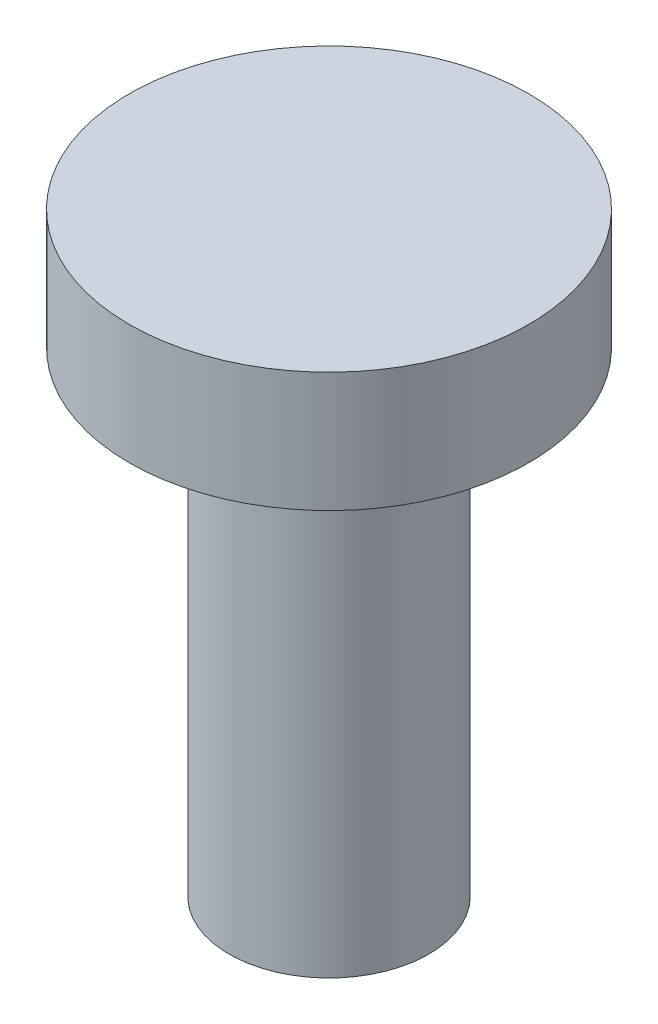
ISO-10303-21;
HEADER;
FILE_DESCRIPTION(('STEP AP214'),'2;1');
FILE_NAME('part.step','',(''),(''),'','','');
FILE_SCHEMA(('AUTOMOTIVE_DESIGN { 1 0 10303 214 1 1 1 1 }'));
ENDSEC;
DATA;
#1=APPLICATION_CONTEXT('core data for automotive mechanical design processes');
#2=APPLICATION_PROTOCOL_DEFINITION('international standard','automotive_design',2000,#1);
#3=PRODUCT_CONTEXT('',#1,'mechanical');
#4=PRODUCT('Part','Part','',(#3));
#5=PRODUCT_RELATED_PRODUCT_CATEGORY('part','',(#4));
#6=PRODUCT_DEFINITION_FORMATION('','',#4);
#7=PRODUCT_DEFINITION_CONTEXT('part definition',#1,'design');
#8=PRODUCT_DEFINITION('design','',#6,#7);
#9=PRODUCT_DEFINITION_SHAPE('','',#8);
#10=(LENGTH_UNIT() NAMED_UNIT(*) SI_UNIT(.MILLI.,.METRE.));
#11=(NAMED_UNIT(*) PLANE_ANGLE_UNIT() SI_UNIT($,.RADIAN.));
#12=(NAMED_UNIT(*) SI_UNIT($,.STERADIAN.) SOLID_ANGLE_UNIT());
#13=UNCERTAINTY_MEASURE_WITH_UNIT(LENGTH_MEASURE(1.E-05),#10,'distance_accuracy_value','');
#14=(GEOMETRIC_REPRESENTATION_CONTEXT(3) GLOBAL_UNCERTAINTY_ASSIGNED_CONTEXT((#13)) GLOBAL_UNIT_ASSIGNED_CONTEXT((#10,
#11,#12)) REPRESENTATION_CONTEXT('',''));
#15=CARTESIAN_POINT('',(0.,0.,0.));
#16=DIRECTION('',(0.,0.,1.));
#17=DIRECTION('',(1.,0.,0.));
#18=AXIS2_PLACEMENT_3D('',#15,#16,#17);
#19=CARTESIAN_POINT('',(0.,3.,0.));
#20=DIRECTION('',(0.,-1.,0.));
#21=DIRECTION('',(0.,0.,-1.));
#22=AXIS2_PLACEMENT_3D('',#19,#20,#21);
#23=CYLINDRICAL_SURFACE('',#22,5.);
#24=CARTESIAN_POINT('',(0.,3.,0.));
#25=DIRECTION('',(0.,1.,0.));
#26=DIRECTION('',(0.,0.,1.));
#27=AXIS2_PLACEMENT_3D('',#24,#25,#26);
#28=CIRCLE('',#27,5.);
#29=CARTESIAN_POINT('',(0.,3.,5.));
#30=VERTEX_POINT('',#29);
#31=EDGE_CURVE('E38',#30,#30,#28,.T.);
#32=ORIENTED_EDGE('',*,*,#31,.F.);
#33=EDGE_LOOP('',(#32));
#34=FACE_BOUND('',#33,.T.);
#35=CARTESIAN_POINT('',(0.,0.,0.));
#36=DIRECTION('',(0.,1.,0.));
#37=DIRECTION('',(0.,0.,1.));
#38=AXIS2_PLACEMENT_3D('',#35,#36,#37);
#39=CIRCLE('',#38,5.);
#40=CARTESIAN_POINT('',(0.,0.,5.));
#41=VERTEX_POINT('',#40);
#42=EDGE_CURVE('E34',#41,#41,#39,.T.);
#43=ORIENTED_EDGE('',*,*,#42,.T.);
#44=EDGE_LOOP('',(#43));
#45=FACE_BOUND('',#44,.T.);
#46=ADVANCED_FACE('F31',(#34,#45),#23,.T.);
#47=CARTESIAN_POINT('',(0.,3.,0.));
#48=DIRECTION('',(0.,1.,0.));
#49=DIRECTION('',(0.,0.,1.));
#50=AXIS2_PLACEMENT_3D('',#47,#48,#49);
#51=PLANE('',#50);
#52=ORIENTED_EDGE('',*,*,#31,.T.);
#53=EDGE_LOOP('',(#52));
#54=FACE_BOUND('',#53,.T.);
#55=ADVANCED_FACE('F55',(#54),#51,.T.);
#56=CARTESIAN_POINT('',(0.,0.,0.));
#57=DIRECTION('',(0.,1.,0.));
#58=DIRECTION('',(0.,0.,1.));
#59=AXIS2_PLACEMENT_3D('',#56,#57,#58);
#60=PLANE('',#59);
#61=CARTESIAN_POINT('',(0.,0.,0.));
#62=DIRECTION('',(0.,-1.,0.));
#63=DIRECTION('',(0.,0.,-1.));
#64=AXIS2_PLACEMENT_3D('',#61,#62,#63);
#65=CIRCLE('',#64,2.5);
#66=CARTESIAN_POINT('',(0.,0.,-2.5));
#67=VERTEX_POINT('',#66);
#68=EDGE_CURVE('E10',#67,#67,#65,.T.);
#69=ORIENTED_EDGE('',*,*,#68,.F.);
#70=EDGE_LOOP('',(#69));
#71=FACE_BOUND('',#70,.T.);
#72=ORIENTED_EDGE('',*,*,#42,.F.);
#73=EDGE_LOOP('',(#72));
#74=FACE_BOUND('',#73,.T.);
#75=ADVANCED_FACE('F52',(#71,#74),#60,.F.);
#76=CARTESIAN_POINT('',(0.,-11.8999,0.));
#77=DIRECTION('',(0.,1.,0.));
#78=DIRECTION('',(0.,0.,1.));
#79=AXIS2_PLACEMENT_3D('',#76,#77,#78);
#80=CYLINDRICAL_SURFACE('',#79,2.5);
#81=CARTESIAN_POINT('',(0.,-11.8999,0.));
#82=DIRECTION('',(0.,-1.,0.));
#83=DIRECTION('',(0.,0.,-1.));
#84=AXIS2_PLACEMENT_3D('',#81,#82,#83);
#85=CIRCLE('',#84,2.5);
#86=CARTESIAN_POINT('',(0.,-11.8999,-2.5));
#87=VERTEX_POINT('',#86);
#88=EDGE_CURVE('E44',#87,#87,#85,.T.);
#89=ORIENTED_EDGE('',*,*,#88,.F.);
#90=EDGE_LOOP('',(#89));
#91=FACE_BOUND('',#90,.T.);
#92=ORIENTED_EDGE('',*,*,#68,.T.);
#93=EDGE_LOOP('',(#92));
#94=FACE_BOUND('',#93,.T.);
#95=ADVANCED_FACE('F54',(#91,#94),#80,.T.);
#96=CARTESIAN_POINT('',(0.,-11.8999,0.));
#97=DIRECTION('',(0.,-1.,0.));
#98=DIRECTION('',(0.,0.,-1.));
#99=AXIS2_PLACEMENT_3D('',#96,#97,#98);
#100=PLANE('',#99);
#101=ORIENTED_EDGE('',*,*,#88,.T.);
#102=EDGE_LOOP('',(#101));
#103=FACE_BOUND('',#102,.T.);
#104=ADVANCED_FACE('F61',(#103),#100,.T.);
#105=CLOSED_SHELL('',(#46,#55,#75,#95,#104));
#106=MANIFOLD_SOLID_BREP('B2',#105);
#107=ADVANCED_BREP_SHAPE_REPRESENTATION('',(#18,#106),#14);
#108=SHAPE_DEFINITION_REPRESENTATION(#9,#107);
ENDSEC;
END-ISO-10303-21;
